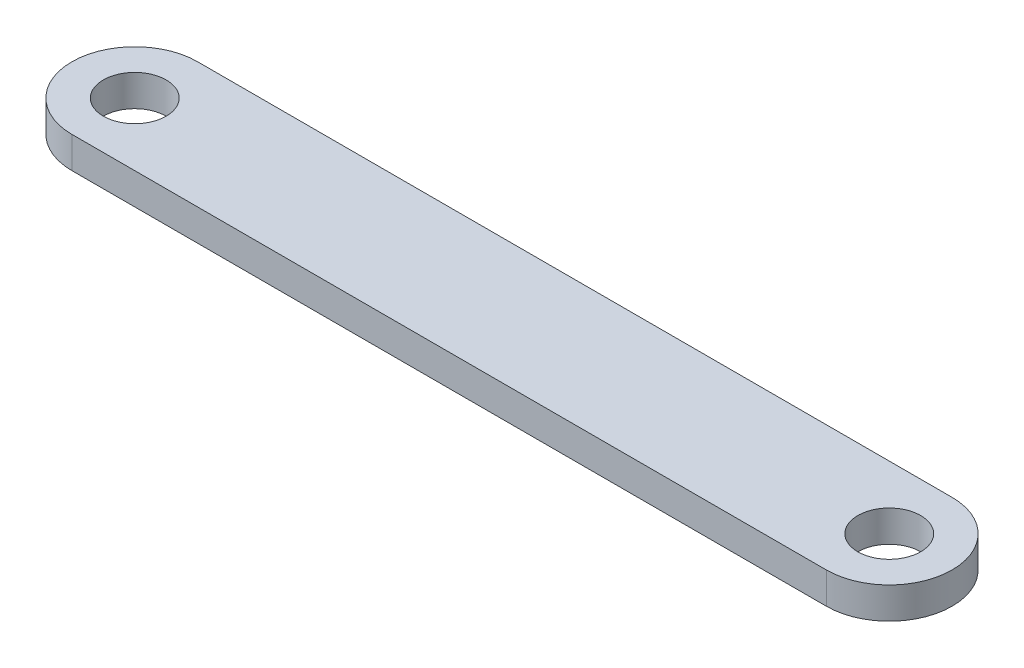
ISO-10303-21;
HEADER;
FILE_DESCRIPTION(('STEP AP214'),'2;1');
FILE_NAME('part.step','',(''),(''),'','','');
FILE_SCHEMA(('AUTOMOTIVE_DESIGN { 1 0 10303 214 1 1 1 1 }'));
ENDSEC;
DATA;
#1=APPLICATION_CONTEXT('core data for automotive mechanical design processes');
#2=APPLICATION_PROTOCOL_DEFINITION('international standard','automotive_design',2000,#1);
#3=PRODUCT_CONTEXT('',#1,'mechanical');
#4=PRODUCT('Part','Part','',(#3));
#5=PRODUCT_RELATED_PRODUCT_CATEGORY('part','',(#4));
#6=PRODUCT_DEFINITION_FORMATION('','',#4);
#7=PRODUCT_DEFINITION_CONTEXT('part definition',#1,'design');
#8=PRODUCT_DEFINITION('design','',#6,#7);
#9=PRODUCT_DEFINITION_SHAPE('','',#8);
#10=(LENGTH_UNIT() NAMED_UNIT(*) SI_UNIT(.MILLI.,.METRE.));
#11=(NAMED_UNIT(*) PLANE_ANGLE_UNIT() SI_UNIT($,.RADIAN.));
#12=(NAMED_UNIT(*) SI_UNIT($,.STERADIAN.) SOLID_ANGLE_UNIT());
#13=UNCERTAINTY_MEASURE_WITH_UNIT(LENGTH_MEASURE(1.E-05),#10,'distance_accuracy_value','');
#14=(GEOMETRIC_REPRESENTATION_CONTEXT(3) GLOBAL_UNCERTAINTY_ASSIGNED_CONTEXT((#13)) GLOBAL_UNIT_ASSIGNED_CONTEXT((#10,
#11,#12)) REPRESENTATION_CONTEXT('',''));
#15=CARTESIAN_POINT('',(0.,0.,0.));
#16=DIRECTION('',(0.,0.,1.));
#17=DIRECTION('',(1.,0.,0.));
#18=AXIS2_PLACEMENT_3D('',#15,#16,#17);
#19=CARTESIAN_POINT('',(-60.,5.,0.));
#20=DIRECTION('',(0.,1.,0.));
#21=DIRECTION('',(0.,0.,1.));
#22=AXIS2_PLACEMENT_3D('',#19,#20,#21);
#23=PLANE('',#22);
#24=CARTESIAN_POINT('',(-60.,5.,0.));
#25=DIRECTION('',(0.,1.,0.));
#26=DIRECTION('',(0.,0.,1.));
#27=AXIS2_PLACEMENT_3D('',#24,#25,#26);
#28=CIRCLE('',#27,5.);
#29=CARTESIAN_POINT('',(-60.,5.,5.));
#30=VERTEX_POINT('',#29);
#31=EDGE_CURVE('E104',#30,#30,#28,.T.);
#32=ORIENTED_EDGE('',*,*,#31,.F.);
#33=EDGE_LOOP('',(#32));
#34=FACE_BOUND('',#33,.T.);
#35=CARTESIAN_POINT('',(-60.,5.,0.));
#36=DIRECTION('',(0.,1.,0.));
#37=DIRECTION('',(0.,0.,1.));
#38=AXIS2_PLACEMENT_3D('',#35,#36,#37);
#39=CIRCLE('',#38,10.);
#40=CARTESIAN_POINT('',(-60.,5.,-10.));
#41=VERTEX_POINT('',#40);
#42=CARTESIAN_POINT('',(-60.,5.,10.));
#43=VERTEX_POINT('',#42);
#44=EDGE_CURVE('E89',#41,#43,#39,.T.);
#45=ORIENTED_EDGE('',*,*,#44,.T.);
#46=DIRECTION('',(1.,0.,0.));
#47=VECTOR('',#46,1.);
#48=CARTESIAN_POINT('',(-60.,5.,10.));
#49=LINE('',#48,#47);
#50=CARTESIAN_POINT('',(60.,5.,10.));
#51=VERTEX_POINT('',#50);
#52=EDGE_CURVE('E84',#43,#51,#49,.T.);
#53=ORIENTED_EDGE('',*,*,#52,.T.);
#54=CARTESIAN_POINT('',(60.,5.,0.));
#55=DIRECTION('',(0.,1.,0.));
#56=DIRECTION('',(0.,0.,1.));
#57=AXIS2_PLACEMENT_3D('',#54,#55,#56);
#58=CIRCLE('',#57,10.);
#59=CARTESIAN_POINT('',(60.,5.,-10.));
#60=VERTEX_POINT('',#59);
#61=EDGE_CURVE('E87',#51,#60,#58,.T.);
#62=ORIENTED_EDGE('',*,*,#61,.T.);
#63=DIRECTION('',(-1.,0.,0.));
#64=VECTOR('',#63,1.);
#65=CARTESIAN_POINT('',(-60.,5.,-10.));
#66=LINE('',#65,#64);
#67=EDGE_CURVE('E54',#60,#41,#66,.T.);
#68=ORIENTED_EDGE('',*,*,#67,.T.);
#69=EDGE_LOOP('',(#45,#53,#62,#68));
#70=FACE_BOUND('',#69,.T.);
#71=CARTESIAN_POINT('',(60.,5.,0.));
#72=DIRECTION('',(0.,1.,0.));
#73=DIRECTION('',(0.,0.,1.));
#74=AXIS2_PLACEMENT_3D('',#71,#72,#73);
#75=CIRCLE('',#74,5.);
#76=CARTESIAN_POINT('',(60.,5.,5.));
#77=VERTEX_POINT('',#76);
#78=EDGE_CURVE('E119',#77,#77,#75,.T.);
#79=ORIENTED_EDGE('',*,*,#78,.F.);
#80=EDGE_LOOP('',(#79));
#81=FACE_BOUND('',#80,.T.);
#82=ADVANCED_FACE('F37',(#34,#70,#81),#23,.T.);
#83=CARTESIAN_POINT('',(-60.,0.,0.));
#84=DIRECTION('',(0.,1.,0.));
#85=DIRECTION('',(0.,0.,1.));
#86=AXIS2_PLACEMENT_3D('',#83,#84,#85);
#87=PLANE('',#86);
#88=CARTESIAN_POINT('',(-60.,0.,0.));
#89=DIRECTION('',(0.,1.,0.));
#90=DIRECTION('',(0.,0.,1.));
#91=AXIS2_PLACEMENT_3D('',#88,#89,#90);
#92=CIRCLE('',#91,10.);
#93=CARTESIAN_POINT('',(-60.,0.,-10.));
#94=VERTEX_POINT('',#93);
#95=CARTESIAN_POINT('',(-60.,0.,10.));
#96=VERTEX_POINT('',#95);
#97=EDGE_CURVE('E101',#94,#96,#92,.T.);
#98=ORIENTED_EDGE('',*,*,#97,.F.);
#99=DIRECTION('',(-1.,0.,0.));
#100=VECTOR('',#99,1.);
#101=CARTESIAN_POINT('',(-60.,0.,-10.));
#102=LINE('',#101,#100);
#103=CARTESIAN_POINT('',(60.,0.,-10.));
#104=VERTEX_POINT('',#103);
#105=EDGE_CURVE('E77',#104,#94,#102,.T.);
#106=ORIENTED_EDGE('',*,*,#105,.F.);
#107=CARTESIAN_POINT('',(60.,0.,0.));
#108=DIRECTION('',(0.,1.,0.));
#109=DIRECTION('',(0.,0.,1.));
#110=AXIS2_PLACEMENT_3D('',#107,#108,#109);
#111=CIRCLE('',#110,10.);
#112=CARTESIAN_POINT('',(60.,0.,10.));
#113=VERTEX_POINT('',#112);
#114=EDGE_CURVE('E71',#113,#104,#111,.T.);
#115=ORIENTED_EDGE('',*,*,#114,.F.);
#116=DIRECTION('',(1.,0.,0.));
#117=VECTOR('',#116,1.);
#118=CARTESIAN_POINT('',(-60.,0.,10.));
#119=LINE('',#118,#117);
#120=EDGE_CURVE('E93',#96,#113,#119,.T.);
#121=ORIENTED_EDGE('',*,*,#120,.F.);
#122=EDGE_LOOP('',(#98,#106,#115,#121));
#123=FACE_BOUND('',#122,.T.);
#124=CARTESIAN_POINT('',(-60.,0.,0.));
#125=DIRECTION('',(0.,1.,0.));
#126=DIRECTION('',(0.,0.,1.));
#127=AXIS2_PLACEMENT_3D('',#124,#125,#126);
#128=CIRCLE('',#127,5.);
#129=CARTESIAN_POINT('',(-60.,0.,5.));
#130=VERTEX_POINT('',#129);
#131=EDGE_CURVE('E116',#130,#130,#128,.T.);
#132=ORIENTED_EDGE('',*,*,#131,.T.);
#133=EDGE_LOOP('',(#132));
#134=FACE_BOUND('',#133,.T.);
#135=CARTESIAN_POINT('',(60.,0.,0.));
#136=DIRECTION('',(0.,1.,0.));
#137=DIRECTION('',(0.,0.,1.));
#138=AXIS2_PLACEMENT_3D('',#135,#136,#137);
#139=CIRCLE('',#138,5.);
#140=CARTESIAN_POINT('',(60.,0.,5.));
#141=VERTEX_POINT('',#140);
#142=EDGE_CURVE('E122',#141,#141,#139,.T.);
#143=ORIENTED_EDGE('',*,*,#142,.T.);
#144=EDGE_LOOP('',(#143));
#145=FACE_BOUND('',#144,.T.);
#146=ADVANCED_FACE('F112',(#123,#134,#145),#87,.F.);
#147=CARTESIAN_POINT('',(-60.,5.,0.));
#148=DIRECTION('',(0.,-1.,0.));
#149=DIRECTION('',(0.,0.,-1.));
#150=AXIS2_PLACEMENT_3D('',#147,#148,#149);
#151=CYLINDRICAL_SURFACE('',#150,10.);
#152=ORIENTED_EDGE('',*,*,#97,.T.);
#153=DIRECTION('',(0.,-1.,0.));
#154=VECTOR('',#153,1.);
#155=CARTESIAN_POINT('',(-60.,5.,10.));
#156=LINE('',#155,#154);
#157=EDGE_CURVE('E11',#43,#96,#156,.T.);
#158=ORIENTED_EDGE('',*,*,#157,.F.);
#159=ORIENTED_EDGE('',*,*,#44,.F.);
#160=DIRECTION('',(0.,-1.,0.));
#161=VECTOR('',#160,1.);
#162=CARTESIAN_POINT('',(-60.,5.,-10.));
#163=LINE('',#162,#161);
#164=EDGE_CURVE('E97',#41,#94,#163,.T.);
#165=ORIENTED_EDGE('',*,*,#164,.T.);
#166=EDGE_LOOP('',(#152,#158,#159,#165));
#167=FACE_BOUND('',#166,.T.);
#168=ADVANCED_FACE('F39',(#167),#151,.T.);
#169=CARTESIAN_POINT('',(-60.,5.,10.));
#170=DIRECTION('',(0.,0.,-1.));
#171=DIRECTION('',(-1.,0.,0.));
#172=AXIS2_PLACEMENT_3D('',#169,#170,#171);
#173=PLANE('',#172);
#174=ORIENTED_EDGE('',*,*,#120,.T.);
#175=DIRECTION('',(0.,-1.,0.));
#176=VECTOR('',#175,1.);
#177=CARTESIAN_POINT('',(60.,5.,10.));
#178=LINE('',#177,#176);
#179=EDGE_CURVE('E46',#51,#113,#178,.T.);
#180=ORIENTED_EDGE('',*,*,#179,.F.);
#181=ORIENTED_EDGE('',*,*,#52,.F.);
#182=ORIENTED_EDGE('',*,*,#157,.T.);
#183=EDGE_LOOP('',(#174,#180,#181,#182));
#184=FACE_BOUND('',#183,.T.);
#185=ADVANCED_FACE('F92',(#184),#173,.F.);
#186=CARTESIAN_POINT('',(60.,5.,0.));
#187=DIRECTION('',(0.,-1.,0.));
#188=DIRECTION('',(0.,0.,-1.));
#189=AXIS2_PLACEMENT_3D('',#186,#187,#188);
#190=CYLINDRICAL_SURFACE('',#189,10.);
#191=ORIENTED_EDGE('',*,*,#114,.T.);
#192=DIRECTION('',(0.,-1.,0.));
#193=VECTOR('',#192,1.);
#194=CARTESIAN_POINT('',(60.,5.,-10.));
#195=LINE('',#194,#193);
#196=EDGE_CURVE('E94',#60,#104,#195,.T.);
#197=ORIENTED_EDGE('',*,*,#196,.F.);
#198=ORIENTED_EDGE('',*,*,#61,.F.);
#199=ORIENTED_EDGE('',*,*,#179,.T.);
#200=EDGE_LOOP('',(#191,#197,#198,#199));
#201=FACE_BOUND('',#200,.T.);
#202=ADVANCED_FACE('F95',(#201),#190,.T.);
#203=CARTESIAN_POINT('',(-60.,5.,-10.));
#204=DIRECTION('',(0.,0.,1.));
#205=DIRECTION('',(1.,0.,0.));
#206=AXIS2_PLACEMENT_3D('',#203,#204,#205);
#207=PLANE('',#206);
#208=ORIENTED_EDGE('',*,*,#105,.T.);
#209=ORIENTED_EDGE('',*,*,#164,.F.);
#210=ORIENTED_EDGE('',*,*,#67,.F.);
#211=ORIENTED_EDGE('',*,*,#196,.T.);
#212=EDGE_LOOP('',(#208,#209,#210,#211));
#213=FACE_BOUND('',#212,.T.);
#214=ADVANCED_FACE('F109',(#213),#207,.F.);
#215=CARTESIAN_POINT('',(-60.,5.,0.));
#216=DIRECTION('',(0.,-1.,0.));
#217=DIRECTION('',(0.,0.,-1.));
#218=AXIS2_PLACEMENT_3D('',#215,#216,#217);
#219=CYLINDRICAL_SURFACE('',#218,5.);
#220=ORIENTED_EDGE('',*,*,#31,.T.);
#221=EDGE_LOOP('',(#220));
#222=FACE_BOUND('',#221,.T.);
#223=ORIENTED_EDGE('',*,*,#131,.F.);
#224=EDGE_LOOP('',(#223));
#225=FACE_BOUND('',#224,.T.);
#226=ADVANCED_FACE('F139',(#222,#225),#219,.F.);
#227=CARTESIAN_POINT('',(60.,5.,0.));
#228=DIRECTION('',(0.,-1.,0.));
#229=DIRECTION('',(0.,0.,-1.));
#230=AXIS2_PLACEMENT_3D('',#227,#228,#229);
#231=CYLINDRICAL_SURFACE('',#230,5.);
#232=ORIENTED_EDGE('',*,*,#78,.T.);
#233=EDGE_LOOP('',(#232));
#234=FACE_BOUND('',#233,.T.);
#235=ORIENTED_EDGE('',*,*,#142,.F.);
#236=EDGE_LOOP('',(#235));
#237=FACE_BOUND('',#236,.T.);
#238=ADVANCED_FACE('F128',(#234,#237),#231,.F.);
#239=CLOSED_SHELL('',(#82,#146,#168,#185,#202,#214,#226,#238));
#240=MANIFOLD_SOLID_BREP('B2',#239);
#241=ADVANCED_BREP_SHAPE_REPRESENTATION('',(#18,#240),#14);
#242=SHAPE_DEFINITION_REPRESENTATION(#9,#241);
ENDSEC;
END-ISO-10303-21;
